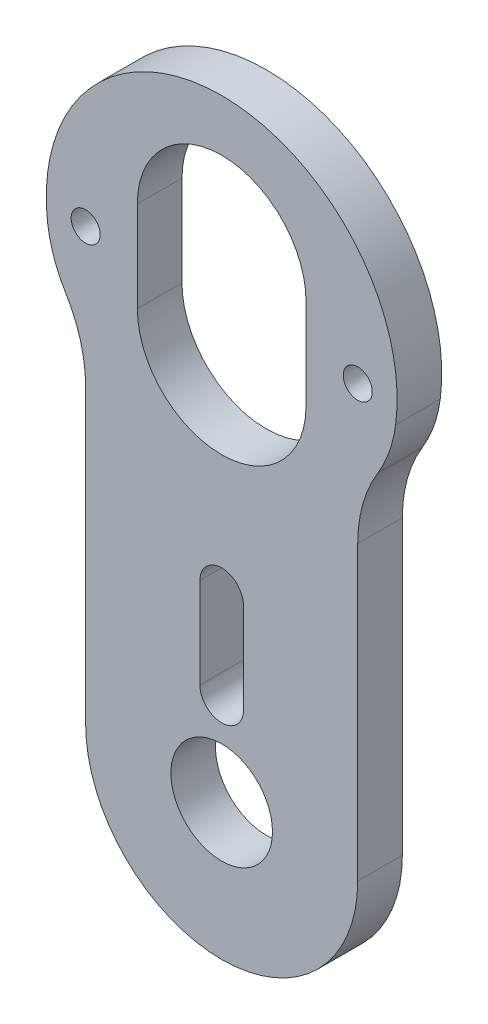
ISO-10303-21;
HEADER;
FILE_DESCRIPTION(('STEP AP214'),'2;1');
FILE_NAME('part.step','',(''),(''),'','','');
FILE_SCHEMA(('AUTOMOTIVE_DESIGN { 1 0 10303 214 1 1 1 1 }'));
ENDSEC;
DATA;
#1=APPLICATION_CONTEXT('core data for automotive mechanical design processes');
#2=APPLICATION_PROTOCOL_DEFINITION('international standard','automotive_design',2000,#1);
#3=PRODUCT_CONTEXT('',#1,'mechanical');
#4=PRODUCT('Part','Part','',(#3));
#5=PRODUCT_RELATED_PRODUCT_CATEGORY('part','',(#4));
#6=PRODUCT_DEFINITION_FORMATION('','',#4);
#7=PRODUCT_DEFINITION_CONTEXT('part definition',#1,'design');
#8=PRODUCT_DEFINITION('design','',#6,#7);
#9=PRODUCT_DEFINITION_SHAPE('','',#8);
#10=(LENGTH_UNIT() NAMED_UNIT(*) SI_UNIT(.MILLI.,.METRE.));
#11=(NAMED_UNIT(*) PLANE_ANGLE_UNIT() SI_UNIT($,.RADIAN.));
#12=(NAMED_UNIT(*) SI_UNIT($,.STERADIAN.) SOLID_ANGLE_UNIT());
#13=UNCERTAINTY_MEASURE_WITH_UNIT(LENGTH_MEASURE(1.E-05),#10,'distance_accuracy_value','');
#14=(GEOMETRIC_REPRESENTATION_CONTEXT(3) GLOBAL_UNCERTAINTY_ASSIGNED_CONTEXT((#13)) GLOBAL_UNIT_ASSIGNED_CONTEXT((#10,
#11,#12)) REPRESENTATION_CONTEXT('',''));
#15=CARTESIAN_POINT('',(0.,0.,0.));
#16=DIRECTION('',(0.,0.,1.));
#17=DIRECTION('',(1.,0.,0.));
#18=AXIS2_PLACEMENT_3D('',#15,#16,#17);
#19=CARTESIAN_POINT('',(9.525,0.,3.1242));
#20=DIRECTION('',(-1.,0.,0.));
#21=DIRECTION('',(0.,0.,1.));
#22=AXIS2_PLACEMENT_3D('',#19,#20,#21);
#23=PLANE('',#22);
#24=DIRECTION('',(0.,1.,0.));
#25=VECTOR('',#24,1.);
#26=CARTESIAN_POINT('',(9.525,0.,0.));
#27=LINE('',#26,#25);
#28=CARTESIAN_POINT('',(9.525,0.,0.));
#29=VERTEX_POINT('',#28);
#30=CARTESIAN_POINT('',(9.525,20.4594589689624,0.));
#31=VERTEX_POINT('',#30);
#32=EDGE_CURVE('E60',#29,#31,#27,.T.);
#33=ORIENTED_EDGE('',*,*,#32,.T.);
#34=DIRECTION('',(0.,0.,1.));
#35=VECTOR('',#34,1.);
#36=CARTESIAN_POINT('',(9.525,20.4594589689624,0.));
#37=LINE('',#36,#35);
#38=CARTESIAN_POINT('',(9.525,20.4594589689624,3.1242));
#39=VERTEX_POINT('',#38);
#40=EDGE_CURVE('E55',#31,#39,#37,.T.);
#41=ORIENTED_EDGE('',*,*,#40,.T.);
#42=DIRECTION('',(0.,1.,0.));
#43=VECTOR('',#42,1.);
#44=CARTESIAN_POINT('',(9.525,0.,3.1242));
#45=LINE('',#44,#43);
#46=CARTESIAN_POINT('',(9.525,0.,3.1242));
#47=VERTEX_POINT('',#46);
#48=EDGE_CURVE('E240',#47,#39,#45,.T.);
#49=ORIENTED_EDGE('',*,*,#48,.F.);
#50=DIRECTION('',(0.,0.,-1.));
#51=VECTOR('',#50,1.);
#52=CARTESIAN_POINT('',(9.525,0.,3.1242));
#53=LINE('',#52,#51);
#54=EDGE_CURVE('E47',#47,#29,#53,.T.);
#55=ORIENTED_EDGE('',*,*,#54,.T.);
#56=EDGE_LOOP('',(#33,#41,#49,#55));
#57=FACE_BOUND('',#56,.T.);
#58=ADVANCED_FACE('F38',(#57),#23,.F.);
#59=CARTESIAN_POINT('',(-9.525,0.,3.1242));
#60=DIRECTION('',(-1.,0.,0.));
#61=DIRECTION('',(0.,0.,1.));
#62=AXIS2_PLACEMENT_3D('',#59,#60,#61);
#63=PLANE('',#62);
#64=DIRECTION('',(0.,1.,0.));
#65=VECTOR('',#64,1.);
#66=CARTESIAN_POINT('',(-9.525,0.,3.1242));
#67=LINE('',#66,#65);
#68=CARTESIAN_POINT('',(-9.525,0.,3.1242));
#69=VERTEX_POINT('',#68);
#70=CARTESIAN_POINT('',(-9.525,20.4594589689624,3.1242));
#71=VERTEX_POINT('',#70);
#72=EDGE_CURVE('E242',#69,#71,#67,.T.);
#73=ORIENTED_EDGE('',*,*,#72,.T.);
#74=DIRECTION('',(0.,0.,1.));
#75=VECTOR('',#74,1.);
#76=CARTESIAN_POINT('',(-9.525,20.4594589689624,0.));
#77=LINE('',#76,#75);
#78=CARTESIAN_POINT('',(-9.525,20.4594589689624,0.));
#79=VERTEX_POINT('',#78);
#80=EDGE_CURVE('E205',#79,#71,#77,.T.);
#81=ORIENTED_EDGE('',*,*,#80,.F.);
#82=DIRECTION('',(0.,1.,0.));
#83=VECTOR('',#82,1.);
#84=CARTESIAN_POINT('',(-9.525,0.,0.));
#85=LINE('',#84,#83);
#86=CARTESIAN_POINT('',(-9.525,0.,0.));
#87=VERTEX_POINT('',#86);
#88=EDGE_CURVE('E273',#87,#79,#85,.T.);
#89=ORIENTED_EDGE('',*,*,#88,.F.);
#90=DIRECTION('',(0.,0.,-1.));
#91=VECTOR('',#90,1.);
#92=CARTESIAN_POINT('',(-9.525,0.,3.1242));
#93=LINE('',#92,#91);
#94=EDGE_CURVE('E11',#69,#87,#93,.T.);
#95=ORIENTED_EDGE('',*,*,#94,.F.);
#96=EDGE_LOOP('',(#73,#81,#89,#95));
#97=FACE_BOUND('',#96,.T.);
#98=ADVANCED_FACE('F341',(#97),#63,.T.);
#99=CARTESIAN_POINT('',(0.,12.7,3.1242));
#100=DIRECTION('',(0.,0.,-1.));
#101=DIRECTION('',(-1.,0.,0.));
#102=AXIS2_PLACEMENT_3D('',#99,#100,#101);
#103=CYLINDRICAL_SURFACE('',#102,1.524);
#104=CARTESIAN_POINT('',(0.,12.7,0.));
#105=DIRECTION('',(0.,0.,1.));
#106=DIRECTION('',(1.,0.,0.));
#107=AXIS2_PLACEMENT_3D('',#104,#105,#106);
#108=CIRCLE('',#107,1.524);
#109=CARTESIAN_POINT('',(1.524,12.7,0.));
#110=VERTEX_POINT('',#109);
#111=CARTESIAN_POINT('',(-1.524,12.7,0.));
#112=VERTEX_POINT('',#111);
#113=EDGE_CURVE('E257',#110,#112,#108,.T.);
#114=ORIENTED_EDGE('',*,*,#113,.F.);
#115=DIRECTION('',(0.,0.,-1.));
#116=VECTOR('',#115,1.);
#117=CARTESIAN_POINT('',(1.524,12.7,3.1242));
#118=LINE('',#117,#116);
#119=CARTESIAN_POINT('',(1.524,12.7,3.1242));
#120=VERTEX_POINT('',#119);
#121=EDGE_CURVE('E277',#120,#110,#118,.T.);
#122=ORIENTED_EDGE('',*,*,#121,.F.);
#123=CARTESIAN_POINT('',(0.,12.7,3.1242));
#124=DIRECTION('',(0.,0.,1.));
#125=DIRECTION('',(1.,0.,0.));
#126=AXIS2_PLACEMENT_3D('',#123,#124,#125);
#127=CIRCLE('',#126,1.524);
#128=CARTESIAN_POINT('',(-1.524,12.7,3.1242));
#129=VERTEX_POINT('',#128);
#130=EDGE_CURVE('E226',#120,#129,#127,.T.);
#131=ORIENTED_EDGE('',*,*,#130,.T.);
#132=DIRECTION('',(0.,0.,-1.));
#133=VECTOR('',#132,1.);
#134=CARTESIAN_POINT('',(-1.524,12.7,3.1242));
#135=LINE('',#134,#133);
#136=EDGE_CURVE('E279',#129,#112,#135,.T.);
#137=ORIENTED_EDGE('',*,*,#136,.T.);
#138=EDGE_LOOP('',(#114,#122,#131,#137));
#139=FACE_BOUND('',#138,.T.);
#140=ADVANCED_FACE('F346',(#139),#103,.F.);
#141=CARTESIAN_POINT('',(1.524,0.,3.1242));
#142=DIRECTION('',(-1.,0.,0.));
#143=DIRECTION('',(0.,0.,1.));
#144=AXIS2_PLACEMENT_3D('',#141,#142,#143);
#145=PLANE('',#144);
#146=DIRECTION('',(0.,1.,0.));
#147=VECTOR('',#146,1.);
#148=CARTESIAN_POINT('',(1.524,0.,0.));
#149=LINE('',#148,#147);
#150=CARTESIAN_POINT('',(1.524,6.35,0.));
#151=VERTEX_POINT('',#150);
#152=EDGE_CURVE('E260',#151,#110,#149,.T.);
#153=ORIENTED_EDGE('',*,*,#152,.F.);
#154=DIRECTION('',(0.,0.,-1.));
#155=VECTOR('',#154,1.);
#156=CARTESIAN_POINT('',(1.524,6.35,3.1242));
#157=LINE('',#156,#155);
#158=CARTESIAN_POINT('',(1.524,6.35,3.1242));
#159=VERTEX_POINT('',#158);
#160=EDGE_CURVE('E283',#159,#151,#157,.T.);
#161=ORIENTED_EDGE('',*,*,#160,.F.);
#162=DIRECTION('',(0.,1.,0.));
#163=VECTOR('',#162,1.);
#164=CARTESIAN_POINT('',(1.524,0.,3.1242));
#165=LINE('',#164,#163);
#166=EDGE_CURVE('E229',#159,#120,#165,.T.);
#167=ORIENTED_EDGE('',*,*,#166,.T.);
#168=ORIENTED_EDGE('',*,*,#121,.T.);
#169=EDGE_LOOP('',(#153,#161,#167,#168));
#170=FACE_BOUND('',#169,.T.);
#171=ADVANCED_FACE('F356',(#170),#145,.T.);
#172=CARTESIAN_POINT('',(0.,6.35,3.1242));
#173=DIRECTION('',(0.,0.,-1.));
#174=DIRECTION('',(-1.,0.,0.));
#175=AXIS2_PLACEMENT_3D('',#172,#173,#174);
#176=CYLINDRICAL_SURFACE('',#175,1.524);
#177=CARTESIAN_POINT('',(0.,6.35,0.));
#178=DIRECTION('',(0.,0.,1.));
#179=DIRECTION('',(1.,0.,0.));
#180=AXIS2_PLACEMENT_3D('',#177,#178,#179);
#181=CIRCLE('',#180,1.524);
#182=CARTESIAN_POINT('',(-1.524,6.35,0.));
#183=VERTEX_POINT('',#182);
#184=EDGE_CURVE('E263',#183,#151,#181,.T.);
#185=ORIENTED_EDGE('',*,*,#184,.F.);
#186=DIRECTION('',(0.,0.,-1.));
#187=VECTOR('',#186,1.);
#188=CARTESIAN_POINT('',(-1.524,6.35,3.1242));
#189=LINE('',#188,#187);
#190=CARTESIAN_POINT('',(-1.524,6.35,3.1242));
#191=VERTEX_POINT('',#190);
#192=EDGE_CURVE('E281',#191,#183,#189,.T.);
#193=ORIENTED_EDGE('',*,*,#192,.F.);
#194=CARTESIAN_POINT('',(0.,6.35,3.1242));
#195=DIRECTION('',(0.,0.,1.));
#196=DIRECTION('',(1.,0.,0.));
#197=AXIS2_PLACEMENT_3D('',#194,#195,#196);
#198=CIRCLE('',#197,1.524);
#199=EDGE_CURVE('E232',#191,#159,#198,.T.);
#200=ORIENTED_EDGE('',*,*,#199,.T.);
#201=ORIENTED_EDGE('',*,*,#160,.T.);
#202=EDGE_LOOP('',(#185,#193,#200,#201));
#203=FACE_BOUND('',#202,.T.);
#204=ADVANCED_FACE('F353',(#203),#176,.F.);
#205=CARTESIAN_POINT('',(0.,26.9875,3.1242));
#206=DIRECTION('',(0.,0.,-1.));
#207=DIRECTION('',(-1.,0.,0.));
#208=AXIS2_PLACEMENT_3D('',#205,#206,#207);
#209=CYLINDRICAL_SURFACE('',#208,5.9055);
#210=DIRECTION('',(0.,0.,-1.));
#211=VECTOR('',#210,1.);
#212=CARTESIAN_POINT('',(5.9055,26.9875,3.1242));
#213=LINE('',#212,#211);
#214=CARTESIAN_POINT('',(5.9055,26.9875,3.1242));
#215=VERTEX_POINT('',#214);
#216=CARTESIAN_POINT('',(5.9055,26.9875,0.));
#217=VERTEX_POINT('',#216);
#218=EDGE_CURVE('E247',#215,#217,#213,.T.);
#219=ORIENTED_EDGE('',*,*,#218,.T.);
#220=CARTESIAN_POINT('',(0.,26.9875,0.));
#221=DIRECTION('',(0.,0.,1.));
#222=DIRECTION('',(1.,0.,0.));
#223=AXIS2_PLACEMENT_3D('',#220,#221,#222);
#224=CIRCLE('',#223,5.9055);
#225=CARTESIAN_POINT('',(-5.9055,26.9875,0.));
#226=VERTEX_POINT('',#225);
#227=EDGE_CURVE('E207',#226,#217,#224,.T.);
#228=ORIENTED_EDGE('',*,*,#227,.F.);
#229=DIRECTION('',(0.,0.,-1.));
#230=VECTOR('',#229,1.);
#231=CARTESIAN_POINT('',(-5.9055,26.9875,3.1242));
#232=LINE('',#231,#230);
#233=CARTESIAN_POINT('',(-5.9055,26.9875,3.1242));
#234=VERTEX_POINT('',#233);
#235=EDGE_CURVE('E42',#234,#226,#232,.T.);
#236=ORIENTED_EDGE('',*,*,#235,.F.);
#237=CARTESIAN_POINT('',(0.,26.9875,3.1242));
#238=DIRECTION('',(0.,0.,1.));
#239=DIRECTION('',(1.,0.,0.));
#240=AXIS2_PLACEMENT_3D('',#237,#238,#239);
#241=CIRCLE('',#240,5.9055);
#242=EDGE_CURVE('E215',#234,#215,#241,.T.);
#243=ORIENTED_EDGE('',*,*,#242,.T.);
#244=EDGE_LOOP('',(#219,#228,#236,#243));
#245=FACE_BOUND('',#244,.T.);
#246=ADVANCED_FACE('F40',(#245),#209,.F.);
#247=CARTESIAN_POINT('',(-5.90549999999999,0.,3.1242));
#248=DIRECTION('',(1.,0.,0.));
#249=DIRECTION('',(0.,1.,0.));
#250=AXIS2_PLACEMENT_3D('',#247,#248,#249);
#251=PLANE('',#250);
#252=DIRECTION('',(0.,-1.,0.));
#253=VECTOR('',#252,1.);
#254=CARTESIAN_POINT('',(-5.90549999999999,0.,0.));
#255=LINE('',#254,#253);
#256=CARTESIAN_POINT('',(-5.9055,33.3375,0.));
#257=VERTEX_POINT('',#256);
#258=EDGE_CURVE('E249',#257,#226,#255,.T.);
#259=ORIENTED_EDGE('',*,*,#258,.F.);
#260=DIRECTION('',(0.,0.,-1.));
#261=VECTOR('',#260,1.);
#262=CARTESIAN_POINT('',(-5.9055,33.3375,3.1242));
#263=LINE('',#262,#261);
#264=CARTESIAN_POINT('',(-5.9055,33.3375,3.1242));
#265=VERTEX_POINT('',#264);
#266=EDGE_CURVE('E289',#265,#257,#263,.T.);
#267=ORIENTED_EDGE('',*,*,#266,.F.);
#268=DIRECTION('',(0.,-1.,0.));
#269=VECTOR('',#268,1.);
#270=CARTESIAN_POINT('',(-5.90549999999999,0.,3.1242));
#271=LINE('',#270,#269);
#272=EDGE_CURVE('E217',#265,#234,#271,.T.);
#273=ORIENTED_EDGE('',*,*,#272,.T.);
#274=ORIENTED_EDGE('',*,*,#235,.T.);
#275=EDGE_LOOP('',(#259,#267,#273,#274));
#276=FACE_BOUND('',#275,.T.);
#277=ADVANCED_FACE('F297',(#276),#251,.T.);
#278=CARTESIAN_POINT('',(0.,33.3375,3.1242));
#279=DIRECTION('',(0.,0.,-1.));
#280=DIRECTION('',(-1.,0.,0.));
#281=AXIS2_PLACEMENT_3D('',#278,#279,#280);
#282=CYLINDRICAL_SURFACE('',#281,5.9055);
#283=ORIENTED_EDGE('',*,*,#266,.T.);
#284=CARTESIAN_POINT('',(0.,33.3375,0.));
#285=DIRECTION('',(0.,0.,1.));
#286=DIRECTION('',(1.,0.,0.));
#287=AXIS2_PLACEMENT_3D('',#284,#285,#286);
#288=CIRCLE('',#287,5.9055);
#289=CARTESIAN_POINT('',(5.9055,33.3375,0.));
#290=VERTEX_POINT('',#289);
#291=EDGE_CURVE('E252',#290,#257,#288,.T.);
#292=ORIENTED_EDGE('',*,*,#291,.F.);
#293=DIRECTION('',(0.,0.,-1.));
#294=VECTOR('',#293,1.);
#295=CARTESIAN_POINT('',(5.9055,33.3375,3.1242));
#296=LINE('',#295,#294);
#297=CARTESIAN_POINT('',(5.9055,33.3375,3.1242));
#298=VERTEX_POINT('',#297);
#299=EDGE_CURVE('E288',#298,#290,#296,.T.);
#300=ORIENTED_EDGE('',*,*,#299,.F.);
#301=CARTESIAN_POINT('',(0.,33.3375,3.1242));
#302=DIRECTION('',(0.,0.,1.));
#303=DIRECTION('',(1.,0.,0.));
#304=AXIS2_PLACEMENT_3D('',#301,#302,#303);
#305=CIRCLE('',#304,5.9055);
#306=EDGE_CURVE('E221',#298,#265,#305,.T.);
#307=ORIENTED_EDGE('',*,*,#306,.T.);
#308=EDGE_LOOP('',(#283,#292,#300,#307));
#309=FACE_BOUND('',#308,.T.);
#310=ADVANCED_FACE('F304',(#309),#282,.F.);
#311=CARTESIAN_POINT('',(0.,0.,3.1242));
#312=DIRECTION('',(0.,0.,-1.));
#313=DIRECTION('',(-1.,0.,0.));
#314=AXIS2_PLACEMENT_3D('',#311,#312,#313);
#315=CYLINDRICAL_SURFACE('',#314,3.556);
#316=CARTESIAN_POINT('',(0.,0.,3.1242));
#317=DIRECTION('',(0.,0.,1.));
#318=DIRECTION('',(1.,0.,0.));
#319=AXIS2_PLACEMENT_3D('',#316,#317,#318);
#320=CIRCLE('',#319,3.556);
#321=CARTESIAN_POINT('',(3.556,0.,3.1242));
#322=VERTEX_POINT('',#321);
#323=EDGE_CURVE('E237',#322,#322,#320,.T.);
#324=ORIENTED_EDGE('',*,*,#323,.T.);
#325=EDGE_LOOP('',(#324));
#326=FACE_BOUND('',#325,.T.);
#327=CARTESIAN_POINT('',(0.,0.,0.));
#328=DIRECTION('',(0.,0.,1.));
#329=DIRECTION('',(1.,0.,0.));
#330=AXIS2_PLACEMENT_3D('',#327,#328,#329);
#331=CIRCLE('',#330,3.556);
#332=CARTESIAN_POINT('',(3.556,0.,0.));
#333=VERTEX_POINT('',#332);
#334=EDGE_CURVE('E269',#333,#333,#331,.T.);
#335=ORIENTED_EDGE('',*,*,#334,.F.);
#336=EDGE_LOOP('',(#335));
#337=FACE_BOUND('',#336,.T.);
#338=ADVANCED_FACE('F321',(#326,#337),#315,.F.);
#339=CARTESIAN_POINT('',(-1.524,0.,3.1242));
#340=DIRECTION('',(-1.,0.,0.));
#341=DIRECTION('',(0.,0.,1.));
#342=AXIS2_PLACEMENT_3D('',#339,#340,#341);
#343=PLANE('',#342);
#344=DIRECTION('',(0.,1.,0.));
#345=VECTOR('',#344,1.);
#346=CARTESIAN_POINT('',(-1.524,0.,0.));
#347=LINE('',#346,#345);
#348=EDGE_CURVE('E266',#183,#112,#347,.T.);
#349=ORIENTED_EDGE('',*,*,#348,.T.);
#350=ORIENTED_EDGE('',*,*,#136,.F.);
#351=DIRECTION('',(0.,1.,0.));
#352=VECTOR('',#351,1.);
#353=CARTESIAN_POINT('',(-1.524,0.,3.1242));
#354=LINE('',#353,#352);
#355=EDGE_CURVE('E235',#191,#129,#354,.T.);
#356=ORIENTED_EDGE('',*,*,#355,.F.);
#357=ORIENTED_EDGE('',*,*,#192,.T.);
#358=EDGE_LOOP('',(#349,#350,#356,#357));
#359=FACE_BOUND('',#358,.T.);
#360=ADVANCED_FACE('F324',(#359),#343,.F.);
#361=CARTESIAN_POINT('',(5.90550000000001,0.,3.1242));
#362=DIRECTION('',(1.,0.,0.));
#363=DIRECTION('',(0.,1.,0.));
#364=AXIS2_PLACEMENT_3D('',#361,#362,#363);
#365=PLANE('',#364);
#366=DIRECTION('',(0.,-1.,0.));
#367=VECTOR('',#366,1.);
#368=CARTESIAN_POINT('',(5.90550000000001,0.,0.));
#369=LINE('',#368,#367);
#370=EDGE_CURVE('E254',#290,#217,#369,.T.);
#371=ORIENTED_EDGE('',*,*,#370,.T.);
#372=ORIENTED_EDGE('',*,*,#218,.F.);
#373=DIRECTION('',(0.,-1.,0.));
#374=VECTOR('',#373,1.);
#375=CARTESIAN_POINT('',(5.90550000000001,0.,3.1242));
#376=LINE('',#375,#374);
#377=EDGE_CURVE('E223',#298,#215,#376,.T.);
#378=ORIENTED_EDGE('',*,*,#377,.F.);
#379=ORIENTED_EDGE('',*,*,#299,.T.);
#380=EDGE_LOOP('',(#371,#372,#378,#379));
#381=FACE_BOUND('',#380,.T.);
#382=ADVANCED_FACE('F308',(#381),#365,.F.);
#383=CARTESIAN_POINT('',(0.,0.,3.1242));
#384=DIRECTION('',(0.,0.,-1.));
#385=DIRECTION('',(-1.,0.,0.));
#386=AXIS2_PLACEMENT_3D('',#383,#384,#385);
#387=CYLINDRICAL_SURFACE('',#386,9.525);
#388=CARTESIAN_POINT('',(0.,0.,0.));
#389=DIRECTION('',(0.,0.,1.));
#390=DIRECTION('',(1.,0.,0.));
#391=AXIS2_PLACEMENT_3D('',#388,#389,#390);
#392=CIRCLE('',#391,9.525);
#393=EDGE_CURVE('E218',#87,#29,#392,.T.);
#394=ORIENTED_EDGE('',*,*,#393,.T.);
#395=ORIENTED_EDGE('',*,*,#54,.F.);
#396=CARTESIAN_POINT('',(0.,0.,3.1242));
#397=DIRECTION('',(0.,0.,1.));
#398=DIRECTION('',(1.,0.,0.));
#399=AXIS2_PLACEMENT_3D('',#396,#397,#398);
#400=CIRCLE('',#399,9.525);
#401=EDGE_CURVE('E245',#69,#47,#400,.T.);
#402=ORIENTED_EDGE('',*,*,#401,.F.);
#403=ORIENTED_EDGE('',*,*,#94,.T.);
#404=EDGE_LOOP('',(#394,#395,#402,#403));
#405=FACE_BOUND('',#404,.T.);
#406=ADVANCED_FACE('F313',(#405),#387,.T.);
#407=CARTESIAN_POINT('',(0.,0.,3.1242));
#408=DIRECTION('',(0.,0.,1.));
#409=DIRECTION('',(1.,0.,0.));
#410=AXIS2_PLACEMENT_3D('',#407,#408,#409);
#411=PLANE('',#410);
#412=CARTESIAN_POINT('',(-9.525,30.1625,3.1242));
#413=DIRECTION('',(0.,0.,1.));
#414=DIRECTION('',(1.,0.,0.));
#415=AXIS2_PLACEMENT_3D('',#412,#413,#414);
#416=CIRCLE('',#415,1.016);
#417=CARTESIAN_POINT('',(-8.509,30.1625,3.1242));
#418=VERTEX_POINT('',#417);
#419=EDGE_CURVE('E202',#418,#418,#416,.T.);
#420=ORIENTED_EDGE('',*,*,#419,.F.);
#421=EDGE_LOOP('',(#420));
#422=FACE_BOUND('',#421,.T.);
#423=CARTESIAN_POINT('',(9.525,30.1625,3.1242));
#424=DIRECTION('',(0.,0.,1.));
#425=DIRECTION('',(1.,0.,0.));
#426=AXIS2_PLACEMENT_3D('',#423,#424,#425);
#427=CIRCLE('',#426,1.016);
#428=CARTESIAN_POINT('',(10.541,30.1625,3.1242));
#429=VERTEX_POINT('',#428);
#430=EDGE_CURVE('E188',#429,#429,#427,.T.);
#431=ORIENTED_EDGE('',*,*,#430,.F.);
#432=EDGE_LOOP('',(#431));
#433=FACE_BOUND('',#432,.T.);
#434=CARTESIAN_POINT('',(0.,30.5797061403509,3.1242));
#435=DIRECTION('',(0.,0.,1.));
#436=DIRECTION('',(1.,0.,0.));
#437=AXIS2_PLACEMENT_3D('',#434,#435,#436);
#438=CIRCLE('',#437,12.2827938596491);
#439=CARTESIAN_POINT('',(-12.1781048878066,28.9794604279005,3.1242));
#440=VERTEX_POINT('',#439);
#441=CARTESIAN_POINT('',(12.1781048878066,28.9794604279005,3.1242));
#442=VERTEX_POINT('',#441);
#443=EDGE_CURVE('E194',#440,#442,#438,.F.);
#444=ORIENTED_EDGE('',*,*,#443,.F.);
#445=CARTESIAN_POINT('',(-3.175,30.1625,3.1242));
#446=DIRECTION('',(0.,0.,1.));
#447=DIRECTION('',(1.,0.,0.));
#448=AXIS2_PLACEMENT_3D('',#445,#446,#447);
#449=CIRCLE('',#448,9.0805);
#450=CARTESIAN_POINT('',(-10.922866894198,25.4268861179577,3.1242));
#451=VERTEX_POINT('',#450);
#452=EDGE_CURVE('E196',#440,#451,#449,.T.);
#453=ORIENTED_EDGE('',*,*,#452,.T.);
#454=CARTESIAN_POINT('',(-19.05,20.4594589689624,3.1242));
#455=DIRECTION('',(0.,0.,1.));
#456=DIRECTION('',(1.,0.,0.));
#457=AXIS2_PLACEMENT_3D('',#454,#455,#456);
#458=CIRCLE('',#457,9.525);
#459=EDGE_CURVE('E199',#451,#71,#458,.F.);
#460=ORIENTED_EDGE('',*,*,#459,.T.);
#461=ORIENTED_EDGE('',*,*,#72,.F.);
#462=ORIENTED_EDGE('',*,*,#401,.T.);
#463=ORIENTED_EDGE('',*,*,#48,.T.);
#464=CARTESIAN_POINT('',(19.05,20.4594589689624,3.1242));
#465=DIRECTION('',(0.,0.,1.));
#466=DIRECTION('',(1.,0.,0.));
#467=AXIS2_PLACEMENT_3D('',#464,#465,#466);
#468=CIRCLE('',#467,9.525);
#469=CARTESIAN_POINT('',(10.922866894198,25.4268861179577,3.1242));
#470=VERTEX_POINT('',#469);
#471=EDGE_CURVE('E191',#470,#39,#468,.T.);
#472=ORIENTED_EDGE('',*,*,#471,.F.);
#473=CARTESIAN_POINT('',(3.175,30.1625,3.1242));
#474=DIRECTION('',(0.,0.,1.));
#475=DIRECTION('',(1.,0.,0.));
#476=AXIS2_PLACEMENT_3D('',#473,#474,#475);
#477=CIRCLE('',#476,9.0805);
#478=EDGE_CURVE('E160',#470,#442,#477,.T.);
#479=ORIENTED_EDGE('',*,*,#478,.T.);
#480=EDGE_LOOP('',(#444,#453,#460,#461,#462,#463,#472,#479));
#481=FACE_BOUND('',#480,.T.);
#482=ORIENTED_EDGE('',*,*,#272,.F.);
#483=ORIENTED_EDGE('',*,*,#306,.F.);
#484=ORIENTED_EDGE('',*,*,#377,.T.);
#485=ORIENTED_EDGE('',*,*,#242,.F.);
#486=EDGE_LOOP('',(#482,#483,#484,#485));
#487=FACE_BOUND('',#486,.T.);
#488=ORIENTED_EDGE('',*,*,#130,.F.);
#489=ORIENTED_EDGE('',*,*,#166,.F.);
#490=ORIENTED_EDGE('',*,*,#199,.F.);
#491=ORIENTED_EDGE('',*,*,#355,.T.);
#492=EDGE_LOOP('',(#488,#489,#490,#491));
#493=FACE_BOUND('',#492,.T.);
#494=ORIENTED_EDGE('',*,*,#323,.F.);
#495=EDGE_LOOP('',(#494));
#496=FACE_BOUND('',#495,.T.);
#497=ADVANCED_FACE('F310',(#422,#433,#481,#487,#493,#496),#411,.T.);
#498=CARTESIAN_POINT('',(0.,0.,0.));
#499=DIRECTION('',(0.,0.,1.));
#500=DIRECTION('',(1.,0.,0.));
#501=AXIS2_PLACEMENT_3D('',#498,#499,#500);
#502=PLANE('',#501);
#503=CARTESIAN_POINT('',(9.525,30.1625,0.));
#504=DIRECTION('',(0.,0.,1.));
#505=DIRECTION('',(1.,0.,0.));
#506=AXIS2_PLACEMENT_3D('',#503,#504,#505);
#507=CIRCLE('',#506,1.016);
#508=CARTESIAN_POINT('',(10.541,30.1625,0.));
#509=VERTEX_POINT('',#508);
#510=EDGE_CURVE('E169',#509,#509,#507,.T.);
#511=ORIENTED_EDGE('',*,*,#510,.T.);
#512=EDGE_LOOP('',(#511));
#513=FACE_BOUND('',#512,.T.);
#514=CARTESIAN_POINT('',(-3.175,30.1625,0.));
#515=DIRECTION('',(0.,0.,1.));
#516=DIRECTION('',(1.,0.,0.));
#517=AXIS2_PLACEMENT_3D('',#514,#515,#516);
#518=CIRCLE('',#517,9.0805);
#519=CARTESIAN_POINT('',(-12.1781048878066,28.9794604279005,0.));
#520=VERTEX_POINT('',#519);
#521=CARTESIAN_POINT('',(-10.922866894198,25.4268861179577,0.));
#522=VERTEX_POINT('',#521);
#523=EDGE_CURVE('E177',#520,#522,#518,.T.);
#524=ORIENTED_EDGE('',*,*,#523,.F.);
#525=CARTESIAN_POINT('',(0.,30.5797061403509,0.));
#526=DIRECTION('',(0.,0.,1.));
#527=DIRECTION('',(1.,0.,0.));
#528=AXIS2_PLACEMENT_3D('',#525,#526,#527);
#529=CIRCLE('',#528,12.2827938596491);
#530=CARTESIAN_POINT('',(12.1781048878066,28.9794604279005,0.));
#531=VERTEX_POINT('',#530);
#532=EDGE_CURVE('E174',#520,#531,#529,.F.);
#533=ORIENTED_EDGE('',*,*,#532,.T.);
#534=CARTESIAN_POINT('',(3.175,30.1625,0.));
#535=DIRECTION('',(0.,0.,1.));
#536=DIRECTION('',(1.,0.,0.));
#537=AXIS2_PLACEMENT_3D('',#534,#535,#536);
#538=CIRCLE('',#537,9.0805);
#539=CARTESIAN_POINT('',(10.922866894198,25.4268861179577,0.));
#540=VERTEX_POINT('',#539);
#541=EDGE_CURVE('E158',#540,#531,#538,.T.);
#542=ORIENTED_EDGE('',*,*,#541,.F.);
#543=CARTESIAN_POINT('',(19.05,20.4594589689624,0.));
#544=DIRECTION('',(0.,0.,1.));
#545=DIRECTION('',(1.,0.,0.));
#546=AXIS2_PLACEMENT_3D('',#543,#544,#545);
#547=CIRCLE('',#546,9.525);
#548=EDGE_CURVE('E166',#540,#31,#547,.T.);
#549=ORIENTED_EDGE('',*,*,#548,.T.);
#550=ORIENTED_EDGE('',*,*,#32,.F.);
#551=ORIENTED_EDGE('',*,*,#393,.F.);
#552=ORIENTED_EDGE('',*,*,#88,.T.);
#553=CARTESIAN_POINT('',(-19.05,20.4594589689624,0.));
#554=DIRECTION('',(0.,0.,1.));
#555=DIRECTION('',(1.,0.,0.));
#556=AXIS2_PLACEMENT_3D('',#553,#554,#555);
#557=CIRCLE('',#556,9.525);
#558=EDGE_CURVE('E183',#522,#79,#557,.F.);
#559=ORIENTED_EDGE('',*,*,#558,.F.);
#560=EDGE_LOOP('',(#524,#533,#542,#549,#550,#551,#552,#559));
#561=FACE_BOUND('',#560,.T.);
#562=ORIENTED_EDGE('',*,*,#291,.T.);
#563=ORIENTED_EDGE('',*,*,#258,.T.);
#564=ORIENTED_EDGE('',*,*,#227,.T.);
#565=ORIENTED_EDGE('',*,*,#370,.F.);
#566=EDGE_LOOP('',(#562,#563,#564,#565));
#567=FACE_BOUND('',#566,.T.);
#568=CARTESIAN_POINT('',(-9.525,30.1625,0.));
#569=DIRECTION('',(0.,0.,1.));
#570=DIRECTION('',(1.,0.,0.));
#571=AXIS2_PLACEMENT_3D('',#568,#569,#570);
#572=CIRCLE('',#571,1.016);
#573=CARTESIAN_POINT('',(-8.509,30.1625,0.));
#574=VERTEX_POINT('',#573);
#575=EDGE_CURVE('E185',#574,#574,#572,.T.);
#576=ORIENTED_EDGE('',*,*,#575,.T.);
#577=EDGE_LOOP('',(#576));
#578=FACE_BOUND('',#577,.T.);
#579=ORIENTED_EDGE('',*,*,#113,.T.);
#580=ORIENTED_EDGE('',*,*,#348,.F.);
#581=ORIENTED_EDGE('',*,*,#184,.T.);
#582=ORIENTED_EDGE('',*,*,#152,.T.);
#583=EDGE_LOOP('',(#579,#580,#581,#582));
#584=FACE_BOUND('',#583,.T.);
#585=ORIENTED_EDGE('',*,*,#334,.T.);
#586=EDGE_LOOP('',(#585));
#587=FACE_BOUND('',#586,.T.);
#588=ADVANCED_FACE('F172',(#513,#561,#567,#578,#584,#587),#502,.F.);
#589=CARTESIAN_POINT('',(0.,30.5797061403509,0.));
#590=DIRECTION('',(0.,0.,1.));
#591=DIRECTION('',(1.,0.,0.));
#592=AXIS2_PLACEMENT_3D('',#589,#590,#591);
#593=CYLINDRICAL_SURFACE('',#592,12.2827938596491);
#594=ORIENTED_EDGE('',*,*,#532,.F.);
#595=DIRECTION('',(0.,0.,1.));
#596=VECTOR('',#595,1.);
#597=CARTESIAN_POINT('',(-12.1781048878066,28.9794604279005,0.));
#598=LINE('',#597,#596);
#599=EDGE_CURVE('E210',#520,#440,#598,.T.);
#600=ORIENTED_EDGE('',*,*,#599,.T.);
#601=ORIENTED_EDGE('',*,*,#443,.T.);
#602=DIRECTION('',(0.,0.,1.));
#603=VECTOR('',#602,1.);
#604=CARTESIAN_POINT('',(12.1781048878066,28.9794604279005,0.));
#605=LINE('',#604,#603);
#606=EDGE_CURVE('E164',#531,#442,#605,.T.);
#607=ORIENTED_EDGE('',*,*,#606,.F.);
#608=EDGE_LOOP('',(#594,#600,#601,#607));
#609=FACE_BOUND('',#608,.T.);
#610=ADVANCED_FACE('F329',(#609),#593,.T.);
#611=CARTESIAN_POINT('',(9.525,30.1625,0.));
#612=DIRECTION('',(0.,0.,1.));
#613=DIRECTION('',(1.,0.,0.));
#614=AXIS2_PLACEMENT_3D('',#611,#612,#613);
#615=CYLINDRICAL_SURFACE('',#614,1.016);
#616=ORIENTED_EDGE('',*,*,#430,.T.);
#617=EDGE_LOOP('',(#616));
#618=FACE_BOUND('',#617,.T.);
#619=ORIENTED_EDGE('',*,*,#510,.F.);
#620=EDGE_LOOP('',(#619));
#621=FACE_BOUND('',#620,.T.);
#622=ADVANCED_FACE('F335',(#618,#621),#615,.F.);
#623=CARTESIAN_POINT('',(-9.525,30.1625,0.));
#624=DIRECTION('',(0.,0.,1.));
#625=DIRECTION('',(1.,0.,0.));
#626=AXIS2_PLACEMENT_3D('',#623,#624,#625);
#627=CYLINDRICAL_SURFACE('',#626,1.016);
#628=ORIENTED_EDGE('',*,*,#419,.T.);
#629=EDGE_LOOP('',(#628));
#630=FACE_BOUND('',#629,.T.);
#631=ORIENTED_EDGE('',*,*,#575,.F.);
#632=EDGE_LOOP('',(#631));
#633=FACE_BOUND('',#632,.T.);
#634=ADVANCED_FACE('F454',(#630,#633),#627,.F.);
#635=CARTESIAN_POINT('',(-19.05,20.4594589689624,0.));
#636=DIRECTION('',(0.,0.,1.));
#637=DIRECTION('',(1.,0.,0.));
#638=AXIS2_PLACEMENT_3D('',#635,#636,#637);
#639=CYLINDRICAL_SURFACE('',#638,9.525);
#640=ORIENTED_EDGE('',*,*,#459,.F.);
#641=DIRECTION('',(0.,0.,1.));
#642=VECTOR('',#641,1.);
#643=CARTESIAN_POINT('',(-10.922866894198,25.4268861179577,0.));
#644=LINE('',#643,#642);
#645=EDGE_CURVE('E208',#522,#451,#644,.T.);
#646=ORIENTED_EDGE('',*,*,#645,.F.);
#647=ORIENTED_EDGE('',*,*,#558,.T.);
#648=ORIENTED_EDGE('',*,*,#80,.T.);
#649=EDGE_LOOP('',(#640,#646,#647,#648));
#650=FACE_BOUND('',#649,.T.);
#651=ADVANCED_FACE('F448',(#650),#639,.F.);
#652=CARTESIAN_POINT('',(-3.175,30.1625,0.));
#653=DIRECTION('',(0.,0.,1.));
#654=DIRECTION('',(1.,0.,0.));
#655=AXIS2_PLACEMENT_3D('',#652,#653,#654);
#656=CYLINDRICAL_SURFACE('',#655,9.0805);
#657=ORIENTED_EDGE('',*,*,#452,.F.);
#658=ORIENTED_EDGE('',*,*,#599,.F.);
#659=ORIENTED_EDGE('',*,*,#523,.T.);
#660=ORIENTED_EDGE('',*,*,#645,.T.);
#661=EDGE_LOOP('',(#657,#658,#659,#660));
#662=FACE_BOUND('',#661,.T.);
#663=ADVANCED_FACE('F453',(#662),#656,.T.);
#664=CARTESIAN_POINT('',(3.175,30.1625,0.));
#665=DIRECTION('',(0.,0.,1.));
#666=DIRECTION('',(1.,0.,0.));
#667=AXIS2_PLACEMENT_3D('',#664,#665,#666);
#668=CYLINDRICAL_SURFACE('',#667,9.0805);
#669=ORIENTED_EDGE('',*,*,#478,.F.);
#670=DIRECTION('',(0.,0.,1.));
#671=VECTOR('',#670,1.);
#672=CARTESIAN_POINT('',(10.922866894198,25.4268861179577,0.));
#673=LINE('',#672,#671);
#674=EDGE_CURVE('E153',#540,#470,#673,.T.);
#675=ORIENTED_EDGE('',*,*,#674,.F.);
#676=ORIENTED_EDGE('',*,*,#541,.T.);
#677=ORIENTED_EDGE('',*,*,#606,.T.);
#678=EDGE_LOOP('',(#669,#675,#676,#677));
#679=FACE_BOUND('',#678,.T.);
#680=ADVANCED_FACE('F155',(#679),#668,.T.);
#681=CARTESIAN_POINT('',(19.05,20.4594589689624,0.));
#682=DIRECTION('',(0.,0.,1.));
#683=DIRECTION('',(1.,0.,0.));
#684=AXIS2_PLACEMENT_3D('',#681,#682,#683);
#685=CYLINDRICAL_SURFACE('',#684,9.525);
#686=ORIENTED_EDGE('',*,*,#471,.T.);
#687=ORIENTED_EDGE('',*,*,#40,.F.);
#688=ORIENTED_EDGE('',*,*,#548,.F.);
#689=ORIENTED_EDGE('',*,*,#674,.T.);
#690=EDGE_LOOP('',(#686,#687,#688,#689));
#691=FACE_BOUND('',#690,.T.);
#692=ADVANCED_FACE('F167',(#691),#685,.F.);
#693=CLOSED_SHELL('',(#58,#98,#140,#171,#204,#246,#277,#310,#338,#360,#382,#406,#497,#588,#610,
#622,#634,#651,#663,#680,#692));
#694=MANIFOLD_SOLID_BREP('B2',#693);
#695=ADVANCED_BREP_SHAPE_REPRESENTATION('',(#18,#694),#14);
#696=SHAPE_DEFINITION_REPRESENTATION(#9,#695);
ENDSEC;
END-ISO-10303-21;
